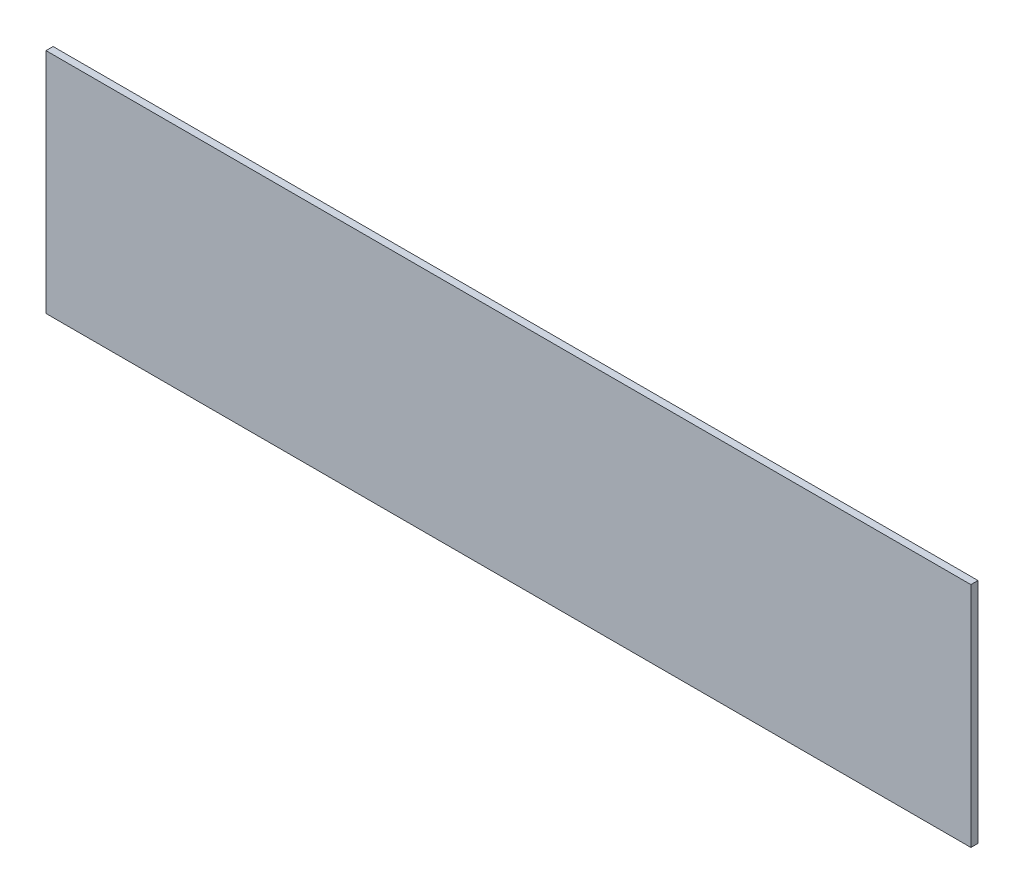
ISO-10303-21;
HEADER;
FILE_DESCRIPTION(('STEP AP214'),'2;1');
FILE_NAME('part.step','',(''),(''),'','','');
FILE_SCHEMA(('AUTOMOTIVE_DESIGN { 1 0 10303 214 1 1 1 1 }'));
ENDSEC;
DATA;
#1=APPLICATION_CONTEXT('core data for automotive mechanical design processes');
#2=APPLICATION_PROTOCOL_DEFINITION('international standard','automotive_design',2000,#1);
#3=PRODUCT_CONTEXT('',#1,'mechanical');
#4=PRODUCT('Part','Part','',(#3));
#5=PRODUCT_RELATED_PRODUCT_CATEGORY('part','',(#4));
#6=PRODUCT_DEFINITION_FORMATION('','',#4);
#7=PRODUCT_DEFINITION_CONTEXT('part definition',#1,'design');
#8=PRODUCT_DEFINITION('design','',#6,#7);
#9=PRODUCT_DEFINITION_SHAPE('','',#8);
#10=(LENGTH_UNIT() NAMED_UNIT(*) SI_UNIT(.MILLI.,.METRE.));
#11=(NAMED_UNIT(*) PLANE_ANGLE_UNIT() SI_UNIT($,.RADIAN.));
#12=(NAMED_UNIT(*) SI_UNIT($,.STERADIAN.) SOLID_ANGLE_UNIT());
#13=UNCERTAINTY_MEASURE_WITH_UNIT(LENGTH_MEASURE(1.E-05),#10,'distance_accuracy_value','');
#14=(GEOMETRIC_REPRESENTATION_CONTEXT(3) GLOBAL_UNCERTAINTY_ASSIGNED_CONTEXT((#13)) GLOBAL_UNIT_ASSIGNED_CONTEXT((#10,
#11,#12)) REPRESENTATION_CONTEXT('',''));
#15=CARTESIAN_POINT('',(0.,0.,0.));
#16=DIRECTION('',(0.,0.,1.));
#17=DIRECTION('',(1.,0.,0.));
#18=AXIS2_PLACEMENT_3D('',#15,#16,#17);
#19=CARTESIAN_POINT('',(130.,32.,2.));
#20=DIRECTION('',(-1.,0.,0.));
#21=DIRECTION('',(0.,-1.,0.));
#22=AXIS2_PLACEMENT_3D('',#19,#20,#21);
#23=PLANE('',#22);
#24=DIRECTION('',(0.,1.,0.));
#25=VECTOR('',#24,1.);
#26=CARTESIAN_POINT('',(130.,32.,0.));
#27=LINE('',#26,#25);
#28=CARTESIAN_POINT('',(130.,-32.,0.));
#29=VERTEX_POINT('',#28);
#30=CARTESIAN_POINT('',(130.,32.,0.));
#31=VERTEX_POINT('',#30);
#32=EDGE_CURVE('E96',#29,#31,#27,.T.);
#33=ORIENTED_EDGE('',*,*,#32,.T.);
#34=DIRECTION('',(0.,0.,-1.));
#35=VECTOR('',#34,1.);
#36=CARTESIAN_POINT('',(130.,32.,2.));
#37=LINE('',#36,#35);
#38=CARTESIAN_POINT('',(130.,32.,2.));
#39=VERTEX_POINT('',#38);
#40=EDGE_CURVE('E11',#39,#31,#37,.T.);
#41=ORIENTED_EDGE('',*,*,#40,.F.);
#42=DIRECTION('',(0.,1.,0.));
#43=VECTOR('',#42,1.);
#44=CARTESIAN_POINT('',(130.,32.,2.));
#45=LINE('',#44,#43);
#46=CARTESIAN_POINT('',(130.,-32.,2.));
#47=VERTEX_POINT('',#46);
#48=EDGE_CURVE('E84',#47,#39,#45,.T.);
#49=ORIENTED_EDGE('',*,*,#48,.F.);
#50=DIRECTION('',(0.,0.,-1.));
#51=VECTOR('',#50,1.);
#52=CARTESIAN_POINT('',(130.,-32.,2.));
#53=LINE('',#52,#51);
#54=EDGE_CURVE('E92',#47,#29,#53,.T.);
#55=ORIENTED_EDGE('',*,*,#54,.T.);
#56=EDGE_LOOP('',(#33,#41,#49,#55));
#57=FACE_BOUND('',#56,.T.);
#58=ADVANCED_FACE('F33',(#57),#23,.F.);
#59=CARTESIAN_POINT('',(-130.,32.,2.));
#60=DIRECTION('',(0.,-1.,0.));
#61=DIRECTION('',(0.,0.,-1.));
#62=AXIS2_PLACEMENT_3D('',#59,#60,#61);
#63=PLANE('',#62);
#64=DIRECTION('',(-1.,0.,0.));
#65=VECTOR('',#64,1.);
#66=CARTESIAN_POINT('',(-130.,32.,0.));
#67=LINE('',#66,#65);
#68=CARTESIAN_POINT('',(-130.,32.,0.));
#69=VERTEX_POINT('',#68);
#70=EDGE_CURVE('E88',#31,#69,#67,.T.);
#71=ORIENTED_EDGE('',*,*,#70,.T.);
#72=DIRECTION('',(0.,0.,-1.));
#73=VECTOR('',#72,1.);
#74=CARTESIAN_POINT('',(-130.,32.,2.));
#75=LINE('',#74,#73);
#76=CARTESIAN_POINT('',(-130.,32.,2.));
#77=VERTEX_POINT('',#76);
#78=EDGE_CURVE('E41',#77,#69,#75,.T.);
#79=ORIENTED_EDGE('',*,*,#78,.F.);
#80=DIRECTION('',(-1.,0.,0.));
#81=VECTOR('',#80,1.);
#82=CARTESIAN_POINT('',(-130.,32.,2.));
#83=LINE('',#82,#81);
#84=EDGE_CURVE('E79',#39,#77,#83,.T.);
#85=ORIENTED_EDGE('',*,*,#84,.F.);
#86=ORIENTED_EDGE('',*,*,#40,.T.);
#87=EDGE_LOOP('',(#71,#79,#85,#86));
#88=FACE_BOUND('',#87,.T.);
#89=ADVANCED_FACE('F87',(#88),#63,.F.);
#90=CARTESIAN_POINT('',(-130.,32.,2.));
#91=DIRECTION('',(1.,0.,0.));
#92=DIRECTION('',(0.,0.,-1.));
#93=AXIS2_PLACEMENT_3D('',#90,#91,#92);
#94=PLANE('',#93);
#95=DIRECTION('',(0.,-1.,0.));
#96=VECTOR('',#95,1.);
#97=CARTESIAN_POINT('',(-130.,32.,0.));
#98=LINE('',#97,#96);
#99=CARTESIAN_POINT('',(-130.,-32.,0.));
#100=VERTEX_POINT('',#99);
#101=EDGE_CURVE('E66',#69,#100,#98,.T.);
#102=ORIENTED_EDGE('',*,*,#101,.T.);
#103=DIRECTION('',(0.,0.,-1.));
#104=VECTOR('',#103,1.);
#105=CARTESIAN_POINT('',(-130.,-32.,2.));
#106=LINE('',#105,#104);
#107=CARTESIAN_POINT('',(-130.,-32.,2.));
#108=VERTEX_POINT('',#107);
#109=EDGE_CURVE('E89',#108,#100,#106,.T.);
#110=ORIENTED_EDGE('',*,*,#109,.F.);
#111=DIRECTION('',(0.,-1.,0.));
#112=VECTOR('',#111,1.);
#113=CARTESIAN_POINT('',(-130.,32.,2.));
#114=LINE('',#113,#112);
#115=EDGE_CURVE('E82',#77,#108,#114,.T.);
#116=ORIENTED_EDGE('',*,*,#115,.F.);
#117=ORIENTED_EDGE('',*,*,#78,.T.);
#118=EDGE_LOOP('',(#102,#110,#116,#117));
#119=FACE_BOUND('',#118,.T.);
#120=ADVANCED_FACE('F90',(#119),#94,.F.);
#121=CARTESIAN_POINT('',(-130.,-32.,2.));
#122=DIRECTION('',(0.,1.,0.));
#123=DIRECTION('',(0.,0.,1.));
#124=AXIS2_PLACEMENT_3D('',#121,#122,#123);
#125=PLANE('',#124);
#126=DIRECTION('',(1.,0.,0.));
#127=VECTOR('',#126,1.);
#128=CARTESIAN_POINT('',(-130.,-32.,0.));
#129=LINE('',#128,#127);
#130=EDGE_CURVE('E72',#100,#29,#129,.T.);
#131=ORIENTED_EDGE('',*,*,#130,.T.);
#132=ORIENTED_EDGE('',*,*,#54,.F.);
#133=DIRECTION('',(1.,0.,0.));
#134=VECTOR('',#133,1.);
#135=CARTESIAN_POINT('',(-130.,-32.,2.));
#136=LINE('',#135,#134);
#137=EDGE_CURVE('E49',#108,#47,#136,.T.);
#138=ORIENTED_EDGE('',*,*,#137,.F.);
#139=ORIENTED_EDGE('',*,*,#109,.T.);
#140=EDGE_LOOP('',(#131,#132,#138,#139));
#141=FACE_BOUND('',#140,.T.);
#142=ADVANCED_FACE('F103',(#141),#125,.F.);
#143=CARTESIAN_POINT('',(0.,0.,2.));
#144=DIRECTION('',(0.,0.,1.));
#145=DIRECTION('',(1.,0.,0.));
#146=AXIS2_PLACEMENT_3D('',#143,#144,#145);
#147=PLANE('',#146);
#148=ORIENTED_EDGE('',*,*,#48,.T.);
#149=ORIENTED_EDGE('',*,*,#84,.T.);
#150=ORIENTED_EDGE('',*,*,#115,.T.);
#151=ORIENTED_EDGE('',*,*,#137,.T.);
#152=EDGE_LOOP('',(#148,#149,#150,#151));
#153=FACE_BOUND('',#152,.T.);
#154=ADVANCED_FACE('F80',(#153),#147,.T.);
#155=CARTESIAN_POINT('',(0.,0.,0.));
#156=DIRECTION('',(0.,0.,1.));
#157=DIRECTION('',(1.,0.,0.));
#158=AXIS2_PLACEMENT_3D('',#155,#156,#157);
#159=PLANE('',#158);
#160=ORIENTED_EDGE('',*,*,#32,.F.);
#161=ORIENTED_EDGE('',*,*,#130,.F.);
#162=ORIENTED_EDGE('',*,*,#101,.F.);
#163=ORIENTED_EDGE('',*,*,#70,.F.);
#164=EDGE_LOOP('',(#160,#161,#162,#163));
#165=FACE_BOUND('',#164,.T.);
#166=ADVANCED_FACE('F106',(#165),#159,.F.);
#167=CLOSED_SHELL('',(#58,#89,#120,#142,#154,#166));
#168=MANIFOLD_SOLID_BREP('B2',#167);
#169=ADVANCED_BREP_SHAPE_REPRESENTATION('',(#18,#168),#14);
#170=SHAPE_DEFINITION_REPRESENTATION(#9,#169);
ENDSEC;
END-ISO-10303-21;
